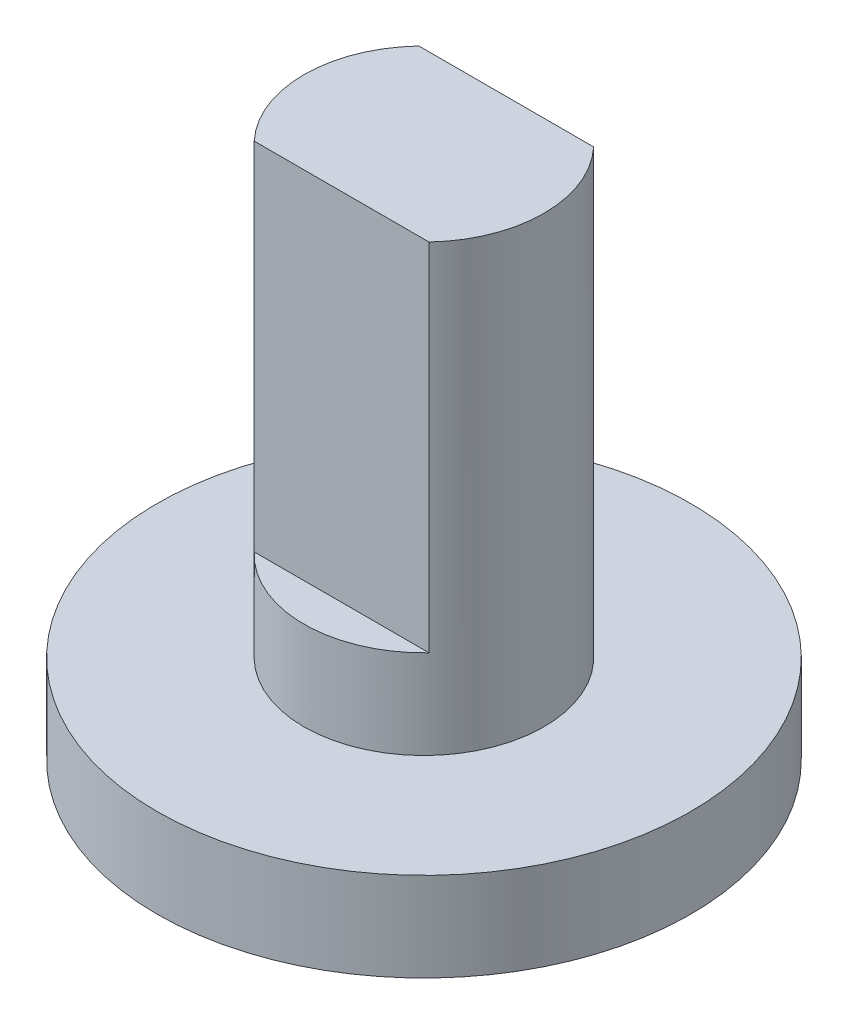
ISO-10303-21;
HEADER;
FILE_DESCRIPTION(('STEP AP214'),'2;1');
FILE_NAME('part.step','',(''),(''),'','','');
FILE_SCHEMA(('AUTOMOTIVE_DESIGN { 1 0 10303 214 1 1 1 1 }'));
ENDSEC;
DATA;
#1=APPLICATION_CONTEXT('core data for automotive mechanical design processes');
#2=APPLICATION_PROTOCOL_DEFINITION('international standard','automotive_design',2000,#1);
#3=PRODUCT_CONTEXT('',#1,'mechanical');
#4=PRODUCT('Part','Part','',(#3));
#5=PRODUCT_RELATED_PRODUCT_CATEGORY('part','',(#4));
#6=PRODUCT_DEFINITION_FORMATION('','',#4);
#7=PRODUCT_DEFINITION_CONTEXT('part definition',#1,'design');
#8=PRODUCT_DEFINITION('design','',#6,#7);
#9=PRODUCT_DEFINITION_SHAPE('','',#8);
#10=(LENGTH_UNIT() NAMED_UNIT(*) SI_UNIT(.MILLI.,.METRE.));
#11=(NAMED_UNIT(*) PLANE_ANGLE_UNIT() SI_UNIT($,.RADIAN.));
#12=(NAMED_UNIT(*) SI_UNIT($,.STERADIAN.) SOLID_ANGLE_UNIT());
#13=UNCERTAINTY_MEASURE_WITH_UNIT(LENGTH_MEASURE(1.E-05),#10,'distance_accuracy_value','');
#14=(GEOMETRIC_REPRESENTATION_CONTEXT(3) GLOBAL_UNCERTAINTY_ASSIGNED_CONTEXT((#13)) GLOBAL_UNIT_ASSIGNED_CONTEXT((#10,
#11,#12)) REPRESENTATION_CONTEXT('',''));
#15=CARTESIAN_POINT('',(0.,0.,0.));
#16=DIRECTION('',(0.,0.,1.));
#17=DIRECTION('',(1.,0.,0.));
#18=AXIS2_PLACEMENT_3D('',#15,#16,#17);
#19=CARTESIAN_POINT('',(0.,2.,0.));
#20=DIRECTION('',(0.,-1.,0.));
#21=DIRECTION('',(0.,0.,-1.));
#22=AXIS2_PLACEMENT_3D('',#19,#20,#21);
#23=CYLINDRICAL_SURFACE('',#22,6.);
#24=CARTESIAN_POINT('',(0.,2.,0.));
#25=DIRECTION('',(0.,1.,0.));
#26=DIRECTION('',(0.,0.,1.));
#27=AXIS2_PLACEMENT_3D('',#24,#25,#26);
#28=CIRCLE('',#27,6.);
#29=CARTESIAN_POINT('',(0.,2.,6.));
#30=VERTEX_POINT('',#29);
#31=EDGE_CURVE('E48',#30,#30,#28,.T.);
#32=ORIENTED_EDGE('',*,*,#31,.F.);
#33=EDGE_LOOP('',(#32));
#34=FACE_BOUND('',#33,.T.);
#35=CARTESIAN_POINT('',(0.,0.,0.));
#36=DIRECTION('',(0.,1.,0.));
#37=DIRECTION('',(0.,0.,1.));
#38=AXIS2_PLACEMENT_3D('',#35,#36,#37);
#39=CIRCLE('',#38,6.);
#40=CARTESIAN_POINT('',(0.,0.,6.));
#41=VERTEX_POINT('',#40);
#42=EDGE_CURVE('E42',#41,#41,#39,.T.);
#43=ORIENTED_EDGE('',*,*,#42,.T.);
#44=EDGE_LOOP('',(#43));
#45=FACE_BOUND('',#44,.T.);
#46=ADVANCED_FACE('F39',(#34,#45),#23,.T.);
#47=CARTESIAN_POINT('',(0.,2.,0.));
#48=DIRECTION('',(0.,1.,0.));
#49=DIRECTION('',(0.,0.,1.));
#50=AXIS2_PLACEMENT_3D('',#47,#48,#49);
#51=PLANE('',#50);
#52=CARTESIAN_POINT('',(0.,2.,0.));
#53=DIRECTION('',(0.,1.,0.));
#54=DIRECTION('',(0.,0.,1.));
#55=AXIS2_PLACEMENT_3D('',#52,#53,#54);
#56=CIRCLE('',#55,2.7);
#57=CARTESIAN_POINT('',(0.,2.,2.7));
#58=VERTEX_POINT('',#57);
#59=EDGE_CURVE('E11',#58,#58,#56,.T.);
#60=ORIENTED_EDGE('',*,*,#59,.F.);
#61=EDGE_LOOP('',(#60));
#62=FACE_BOUND('',#61,.T.);
#63=ORIENTED_EDGE('',*,*,#31,.T.);
#64=EDGE_LOOP('',(#63));
#65=FACE_BOUND('',#64,.T.);
#66=ADVANCED_FACE('F137',(#62,#65),#51,.T.);
#67=CARTESIAN_POINT('',(0.,0.,0.));
#68=DIRECTION('',(0.,1.,0.));
#69=DIRECTION('',(0.,0.,1.));
#70=AXIS2_PLACEMENT_3D('',#67,#68,#69);
#71=PLANE('',#70);
#72=ORIENTED_EDGE('',*,*,#42,.F.);
#73=EDGE_LOOP('',(#72));
#74=FACE_BOUND('',#73,.T.);
#75=ADVANCED_FACE('F135',(#74),#71,.F.);
#76=CARTESIAN_POINT('',(0.,12.,0.));
#77=DIRECTION('',(0.,-1.,0.));
#78=DIRECTION('',(0.,0.,-1.));
#79=AXIS2_PLACEMENT_3D('',#76,#77,#78);
#80=CYLINDRICAL_SURFACE('',#79,2.7);
#81=CARTESIAN_POINT('',(0.,12.,0.));
#82=DIRECTION('',(0.,1.,0.));
#83=DIRECTION('',(0.,0.,1.));
#84=AXIS2_PLACEMENT_3D('',#81,#82,#83);
#85=CIRCLE('',#84,2.7);
#86=CARTESIAN_POINT('',(-1.965,12.,-1.85169516929758));
#87=VERTEX_POINT('',#86);
#88=CARTESIAN_POINT('',(-1.965,12.,1.85169516929758));
#89=VERTEX_POINT('',#88);
#90=EDGE_CURVE('E101',#87,#89,#85,.T.);
#91=ORIENTED_EDGE('',*,*,#90,.F.);
#92=DIRECTION('',(0.,1.,0.));
#93=VECTOR('',#92,1.);
#94=CARTESIAN_POINT('',(-1.965,4.,-1.85169516929758));
#95=LINE('',#94,#93);
#96=CARTESIAN_POINT('',(-1.965,4.,-1.85169516929758));
#97=VERTEX_POINT('',#96);
#98=EDGE_CURVE('E56',#97,#87,#95,.T.);
#99=ORIENTED_EDGE('',*,*,#98,.F.);
#100=CARTESIAN_POINT('',(0.,4.,0.));
#101=DIRECTION('',(0.,1.,0.));
#102=DIRECTION('',(0.,0.,-1.));
#103=AXIS2_PLACEMENT_3D('',#100,#101,#102);
#104=CIRCLE('',#103,2.70000000000002);
#105=CARTESIAN_POINT('',(1.965,4.,-1.85169516929758));
#106=VERTEX_POINT('',#105);
#107=EDGE_CURVE('E84',#106,#97,#104,.T.);
#108=ORIENTED_EDGE('',*,*,#107,.F.);
#109=DIRECTION('',(0.,1.,0.));
#110=VECTOR('',#109,1.);
#111=CARTESIAN_POINT('',(1.965,4.,-1.85169516929758));
#112=LINE('',#111,#110);
#113=CARTESIAN_POINT('',(1.965,12.,-1.85169516929758));
#114=VERTEX_POINT('',#113);
#115=EDGE_CURVE('E93',#106,#114,#112,.T.);
#116=ORIENTED_EDGE('',*,*,#115,.T.);
#117=CARTESIAN_POINT('',(1.965,12.,1.85169516929758));
#118=VERTEX_POINT('',#117);
#119=EDGE_CURVE('E123',#118,#114,#85,.T.);
#120=ORIENTED_EDGE('',*,*,#119,.F.);
#121=DIRECTION('',(0.,1.,0.));
#122=VECTOR('',#121,1.);
#123=CARTESIAN_POINT('',(1.965,4.,1.85169516929758));
#124=LINE('',#123,#122);
#125=CARTESIAN_POINT('',(1.965,4.,1.85169516929758));
#126=VERTEX_POINT('',#125);
#127=EDGE_CURVE('E64',#126,#118,#124,.T.);
#128=ORIENTED_EDGE('',*,*,#127,.F.);
#129=CARTESIAN_POINT('',(0.,4.,0.));
#130=DIRECTION('',(0.,1.,0.));
#131=DIRECTION('',(0.,0.,1.));
#132=AXIS2_PLACEMENT_3D('',#129,#130,#131);
#133=CIRCLE('',#132,2.70000000000001);
#134=CARTESIAN_POINT('',(-1.965,4.,1.85169516929758));
#135=VERTEX_POINT('',#134);
#136=EDGE_CURVE('E108',#135,#126,#133,.T.);
#137=ORIENTED_EDGE('',*,*,#136,.F.);
#138=DIRECTION('',(0.,1.,0.));
#139=VECTOR('',#138,1.);
#140=CARTESIAN_POINT('',(-1.965,4.,1.85169516929758));
#141=LINE('',#140,#139);
#142=EDGE_CURVE('E118',#135,#89,#141,.T.);
#143=ORIENTED_EDGE('',*,*,#142,.T.);
#144=EDGE_LOOP('',(#91,#99,#108,#116,#120,#128,#137,#143));
#145=FACE_BOUND('',#144,.T.);
#146=ORIENTED_EDGE('',*,*,#59,.T.);
#147=EDGE_LOOP('',(#146));
#148=FACE_BOUND('',#147,.T.);
#149=ADVANCED_FACE('F97',(#145,#148),#80,.T.);
#150=CARTESIAN_POINT('',(0.,12.,0.));
#151=DIRECTION('',(0.,1.,0.));
#152=DIRECTION('',(0.,0.,1.));
#153=AXIS2_PLACEMENT_3D('',#150,#151,#152);
#154=PLANE('',#153);
#155=DIRECTION('',(1.,0.,0.));
#156=VECTOR('',#155,1.);
#157=CARTESIAN_POINT('',(-1.965,12.,-1.85169516929758));
#158=LINE('',#157,#156);
#159=EDGE_CURVE('E90',#87,#114,#158,.T.);
#160=ORIENTED_EDGE('',*,*,#159,.F.);
#161=ORIENTED_EDGE('',*,*,#90,.T.);
#162=DIRECTION('',(-1.,0.,0.));
#163=VECTOR('',#162,1.);
#164=CARTESIAN_POINT('',(-1.965,12.,1.85169516929758));
#165=LINE('',#164,#163);
#166=EDGE_CURVE('E112',#118,#89,#165,.T.);
#167=ORIENTED_EDGE('',*,*,#166,.F.);
#168=ORIENTED_EDGE('',*,*,#119,.T.);
#169=EDGE_LOOP('',(#160,#161,#167,#168));
#170=FACE_BOUND('',#169,.T.);
#171=ADVANCED_FACE('F142',(#170),#154,.T.);
#172=CARTESIAN_POINT('',(-1.965,4.,1.85169516929758));
#173=DIRECTION('',(0.,0.,-1.));
#174=DIRECTION('',(-1.,0.,0.));
#175=AXIS2_PLACEMENT_3D('',#172,#173,#174);
#176=PLANE('',#175);
#177=ORIENTED_EDGE('',*,*,#166,.T.);
#178=ORIENTED_EDGE('',*,*,#142,.F.);
#179=DIRECTION('',(-1.,0.,0.));
#180=VECTOR('',#179,1.);
#181=CARTESIAN_POINT('',(-1.965,4.,1.85169516929758));
#182=LINE('',#181,#180);
#183=EDGE_CURVE('E111',#126,#135,#182,.T.);
#184=ORIENTED_EDGE('',*,*,#183,.F.);
#185=ORIENTED_EDGE('',*,*,#127,.T.);
#186=EDGE_LOOP('',(#177,#178,#184,#185));
#187=FACE_BOUND('',#186,.T.);
#188=ADVANCED_FACE('F171',(#187),#176,.F.);
#189=CARTESIAN_POINT('',(0.,4.,0.));
#190=DIRECTION('',(0.,1.,0.));
#191=DIRECTION('',(0.,0.,1.));
#192=AXIS2_PLACEMENT_3D('',#189,#190,#191);
#193=PLANE('',#192);
#194=ORIENTED_EDGE('',*,*,#136,.T.);
#195=ORIENTED_EDGE('',*,*,#183,.T.);
#196=EDGE_LOOP('',(#194,#195));
#197=FACE_BOUND('',#196,.T.);
#198=ADVANCED_FACE('F181',(#197),#193,.T.);
#199=CARTESIAN_POINT('',(-1.965,4.,-1.85169516929758));
#200=DIRECTION('',(0.,0.,1.));
#201=DIRECTION('',(1.,0.,0.));
#202=AXIS2_PLACEMENT_3D('',#199,#200,#201);
#203=PLANE('',#202);
#204=ORIENTED_EDGE('',*,*,#159,.T.);
#205=ORIENTED_EDGE('',*,*,#115,.F.);
#206=DIRECTION('',(1.,0.,0.));
#207=VECTOR('',#206,1.);
#208=CARTESIAN_POINT('',(-1.965,4.,-1.85169516929758));
#209=LINE('',#208,#207);
#210=EDGE_CURVE('E86',#97,#106,#209,.T.);
#211=ORIENTED_EDGE('',*,*,#210,.F.);
#212=ORIENTED_EDGE('',*,*,#98,.T.);
#213=EDGE_LOOP('',(#204,#205,#211,#212));
#214=FACE_BOUND('',#213,.T.);
#215=ADVANCED_FACE('F92',(#214),#203,.F.);
#216=CARTESIAN_POINT('',(0.,4.,0.));
#217=DIRECTION('',(0.,-1.,0.));
#218=DIRECTION('',(0.,0.,-1.));
#219=AXIS2_PLACEMENT_3D('',#216,#217,#218);
#220=PLANE('',#219);
#221=ORIENTED_EDGE('',*,*,#107,.T.);
#222=ORIENTED_EDGE('',*,*,#210,.T.);
#223=EDGE_LOOP('',(#221,#222));
#224=FACE_BOUND('',#223,.T.);
#225=ADVANCED_FACE('F85',(#224),#220,.F.);
#226=CLOSED_SHELL('',(#46,#66,#75,#149,#171,#188,#198,#215,#225));
#227=MANIFOLD_SOLID_BREP('B2',#226);
#228=ADVANCED_BREP_SHAPE_REPRESENTATION('',(#18,#227),#14);
#229=SHAPE_DEFINITION_REPRESENTATION(#9,#228);
ENDSEC;
END-ISO-10303-21;
